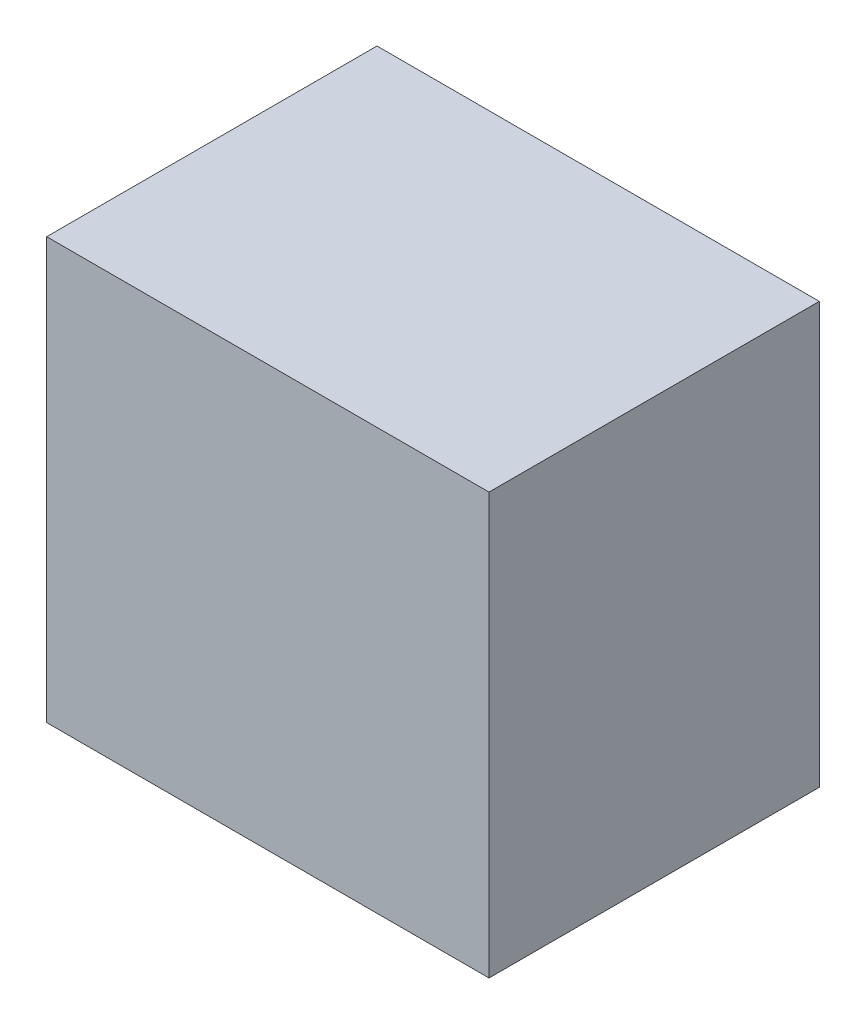
ISO-10303-21;
HEADER;
FILE_DESCRIPTION(('STEP AP214'),'2;1');
FILE_NAME('part.step','',(''),(''),'','','');
FILE_SCHEMA(('AUTOMOTIVE_DESIGN { 1 0 10303 214 1 1 1 1 }'));
ENDSEC;
DATA;
#1=APPLICATION_CONTEXT('core data for automotive mechanical design processes');
#2=APPLICATION_PROTOCOL_DEFINITION('international standard','automotive_design',2000,#1);
#3=PRODUCT_CONTEXT('',#1,'mechanical');
#4=PRODUCT('Part','Part','',(#3));
#5=PRODUCT_RELATED_PRODUCT_CATEGORY('part','',(#4));
#6=PRODUCT_DEFINITION_FORMATION('','',#4);
#7=PRODUCT_DEFINITION_CONTEXT('part definition',#1,'design');
#8=PRODUCT_DEFINITION('design','',#6,#7);
#9=PRODUCT_DEFINITION_SHAPE('','',#8);
#10=(LENGTH_UNIT() NAMED_UNIT(*) SI_UNIT(.MILLI.,.METRE.));
#11=(NAMED_UNIT(*) PLANE_ANGLE_UNIT() SI_UNIT($,.RADIAN.));
#12=(NAMED_UNIT(*) SI_UNIT($,.STERADIAN.) SOLID_ANGLE_UNIT());
#13=UNCERTAINTY_MEASURE_WITH_UNIT(LENGTH_MEASURE(1.E-05),#10,'distance_accuracy_value','');
#14=(GEOMETRIC_REPRESENTATION_CONTEXT(3) GLOBAL_UNCERTAINTY_ASSIGNED_CONTEXT((#13)) GLOBAL_UNIT_ASSIGNED_CONTEXT((#10,
#11,#12)) REPRESENTATION_CONTEXT('',''));
#15=CARTESIAN_POINT('',(0.,0.,0.));
#16=DIRECTION('',(0.,0.,1.));
#17=DIRECTION('',(1.,0.,0.));
#18=AXIS2_PLACEMENT_3D('',#15,#16,#17);
#19=CARTESIAN_POINT('',(117.721879559462,112.,87.9046708308481));
#20=DIRECTION('',(-1.,0.,0.));
#21=DIRECTION('',(0.,0.,1.));
#22=AXIS2_PLACEMENT_3D('',#19,#20,#21);
#23=PLANE('',#22);
#24=DIRECTION('',(0.,0.,-1.));
#25=VECTOR('',#24,1.);
#26=CARTESIAN_POINT('',(117.721879559462,-112.,87.9046708308481));
#27=LINE('',#26,#25);
#28=CARTESIAN_POINT('',(117.721879559462,-112.,87.9046708308481));
#29=VERTEX_POINT('',#28);
#30=CARTESIAN_POINT('',(117.721879559462,-112.,-87.9046708308481));
#31=VERTEX_POINT('',#30);
#32=EDGE_CURVE('E102',#29,#31,#27,.T.);
#33=ORIENTED_EDGE('',*,*,#32,.T.);
#34=DIRECTION('',(0.,-1.,0.));
#35=VECTOR('',#34,1.);
#36=CARTESIAN_POINT('',(117.721879559462,112.,-87.9046708308481));
#37=LINE('',#36,#35);
#38=CARTESIAN_POINT('',(117.721879559462,112.,-87.9046708308481));
#39=VERTEX_POINT('',#38);
#40=EDGE_CURVE('E11',#39,#31,#37,.T.);
#41=ORIENTED_EDGE('',*,*,#40,.F.);
#42=DIRECTION('',(0.,0.,-1.));
#43=VECTOR('',#42,1.);
#44=CARTESIAN_POINT('',(117.721879559462,112.,87.9046708308481));
#45=LINE('',#44,#43);
#46=CARTESIAN_POINT('',(117.721879559462,112.,87.9046708308481));
#47=VERTEX_POINT('',#46);
#48=EDGE_CURVE('E90',#47,#39,#45,.T.);
#49=ORIENTED_EDGE('',*,*,#48,.F.);
#50=DIRECTION('',(0.,-1.,0.));
#51=VECTOR('',#50,1.);
#52=CARTESIAN_POINT('',(117.721879559462,112.,87.9046708308481));
#53=LINE('',#52,#51);
#54=EDGE_CURVE('E98',#47,#29,#53,.T.);
#55=ORIENTED_EDGE('',*,*,#54,.T.);
#56=EDGE_LOOP('',(#33,#41,#49,#55));
#57=FACE_BOUND('',#56,.T.);
#58=ADVANCED_FACE('F39',(#57),#23,.F.);
#59=CARTESIAN_POINT('',(-117.721879559462,112.,-87.9046708308481));
#60=DIRECTION('',(0.,0.,1.));
#61=DIRECTION('',(1.,0.,0.));
#62=AXIS2_PLACEMENT_3D('',#59,#60,#61);
#63=PLANE('',#62);
#64=DIRECTION('',(-1.,0.,0.));
#65=VECTOR('',#64,1.);
#66=CARTESIAN_POINT('',(-117.721879559462,-112.,-87.9046708308481));
#67=LINE('',#66,#65);
#68=CARTESIAN_POINT('',(-117.721879559462,-112.,-87.9046708308481));
#69=VERTEX_POINT('',#68);
#70=EDGE_CURVE('E94',#31,#69,#67,.T.);
#71=ORIENTED_EDGE('',*,*,#70,.T.);
#72=DIRECTION('',(0.,-1.,0.));
#73=VECTOR('',#72,1.);
#74=CARTESIAN_POINT('',(-117.721879559462,112.,-87.9046708308481));
#75=LINE('',#74,#73);
#76=CARTESIAN_POINT('',(-117.721879559462,112.,-87.9046708308481));
#77=VERTEX_POINT('',#76);
#78=EDGE_CURVE('E47',#77,#69,#75,.T.);
#79=ORIENTED_EDGE('',*,*,#78,.F.);
#80=DIRECTION('',(-1.,0.,0.));
#81=VECTOR('',#80,1.);
#82=CARTESIAN_POINT('',(-117.721879559462,112.,-87.9046708308481));
#83=LINE('',#82,#81);
#84=EDGE_CURVE('E85',#39,#77,#83,.T.);
#85=ORIENTED_EDGE('',*,*,#84,.F.);
#86=ORIENTED_EDGE('',*,*,#40,.T.);
#87=EDGE_LOOP('',(#71,#79,#85,#86));
#88=FACE_BOUND('',#87,.T.);
#89=ADVANCED_FACE('F93',(#88),#63,.F.);
#90=CARTESIAN_POINT('',(-117.721879559462,112.,87.9046708308481));
#91=DIRECTION('',(1.,0.,0.));
#92=DIRECTION('',(0.,0.,-1.));
#93=AXIS2_PLACEMENT_3D('',#90,#91,#92);
#94=PLANE('',#93);
#95=DIRECTION('',(0.,0.,1.));
#96=VECTOR('',#95,1.);
#97=CARTESIAN_POINT('',(-117.721879559462,-112.,87.9046708308481));
#98=LINE('',#97,#96);
#99=CARTESIAN_POINT('',(-117.721879559462,-112.,87.9046708308481));
#100=VERTEX_POINT('',#99);
#101=EDGE_CURVE('E72',#69,#100,#98,.T.);
#102=ORIENTED_EDGE('',*,*,#101,.T.);
#103=DIRECTION('',(0.,-1.,0.));
#104=VECTOR('',#103,1.);
#105=CARTESIAN_POINT('',(-117.721879559462,112.,87.9046708308481));
#106=LINE('',#105,#104);
#107=CARTESIAN_POINT('',(-117.721879559462,112.,87.9046708308481));
#108=VERTEX_POINT('',#107);
#109=EDGE_CURVE('E95',#108,#100,#106,.T.);
#110=ORIENTED_EDGE('',*,*,#109,.F.);
#111=DIRECTION('',(0.,0.,1.));
#112=VECTOR('',#111,1.);
#113=CARTESIAN_POINT('',(-117.721879559462,112.,87.9046708308481));
#114=LINE('',#113,#112);
#115=EDGE_CURVE('E88',#77,#108,#114,.T.);
#116=ORIENTED_EDGE('',*,*,#115,.F.);
#117=ORIENTED_EDGE('',*,*,#78,.T.);
#118=EDGE_LOOP('',(#102,#110,#116,#117));
#119=FACE_BOUND('',#118,.T.);
#120=ADVANCED_FACE('F96',(#119),#94,.F.);
#121=CARTESIAN_POINT('',(-117.721879559462,112.,87.9046708308481));
#122=DIRECTION('',(0.,0.,-1.));
#123=DIRECTION('',(-1.,0.,0.));
#124=AXIS2_PLACEMENT_3D('',#121,#122,#123);
#125=PLANE('',#124);
#126=DIRECTION('',(1.,0.,0.));
#127=VECTOR('',#126,1.);
#128=CARTESIAN_POINT('',(-117.721879559462,-112.,87.9046708308481));
#129=LINE('',#128,#127);
#130=EDGE_CURVE('E78',#100,#29,#129,.T.);
#131=ORIENTED_EDGE('',*,*,#130,.T.);
#132=ORIENTED_EDGE('',*,*,#54,.F.);
#133=DIRECTION('',(1.,0.,0.));
#134=VECTOR('',#133,1.);
#135=CARTESIAN_POINT('',(-117.721879559462,112.,87.9046708308481));
#136=LINE('',#135,#134);
#137=EDGE_CURVE('E55',#108,#47,#136,.T.);
#138=ORIENTED_EDGE('',*,*,#137,.F.);
#139=ORIENTED_EDGE('',*,*,#109,.T.);
#140=EDGE_LOOP('',(#131,#132,#138,#139));
#141=FACE_BOUND('',#140,.T.);
#142=ADVANCED_FACE('F109',(#141),#125,.F.);
#143=CARTESIAN_POINT('',(0.,112.,0.));
#144=DIRECTION('',(0.,-1.,0.));
#145=DIRECTION('',(0.,0.,-1.));
#146=AXIS2_PLACEMENT_3D('',#143,#144,#145);
#147=PLANE('',#146);
#148=ORIENTED_EDGE('',*,*,#48,.T.);
#149=ORIENTED_EDGE('',*,*,#84,.T.);
#150=ORIENTED_EDGE('',*,*,#115,.T.);
#151=ORIENTED_EDGE('',*,*,#137,.T.);
#152=EDGE_LOOP('',(#148,#149,#150,#151));
#153=FACE_BOUND('',#152,.T.);
#154=ADVANCED_FACE('F86',(#153),#147,.F.);
#155=CARTESIAN_POINT('',(0.,-112.,0.));
#156=DIRECTION('',(0.,-1.,0.));
#157=DIRECTION('',(0.,0.,-1.));
#158=AXIS2_PLACEMENT_3D('',#155,#156,#157);
#159=PLANE('',#158);
#160=ORIENTED_EDGE('',*,*,#32,.F.);
#161=ORIENTED_EDGE('',*,*,#130,.F.);
#162=ORIENTED_EDGE('',*,*,#101,.F.);
#163=ORIENTED_EDGE('',*,*,#70,.F.);
#164=EDGE_LOOP('',(#160,#161,#162,#163));
#165=FACE_BOUND('',#164,.T.);
#166=ADVANCED_FACE('F112',(#165),#159,.T.);
#167=CLOSED_SHELL('',(#58,#89,#120,#142,#154,#166));
#168=MANIFOLD_SOLID_BREP('B2',#167);
#169=ADVANCED_BREP_SHAPE_REPRESENTATION('',(#18,#168),#14);
#170=SHAPE_DEFINITION_REPRESENTATION(#9,#169);
ENDSEC;
END-ISO-10303-21;
